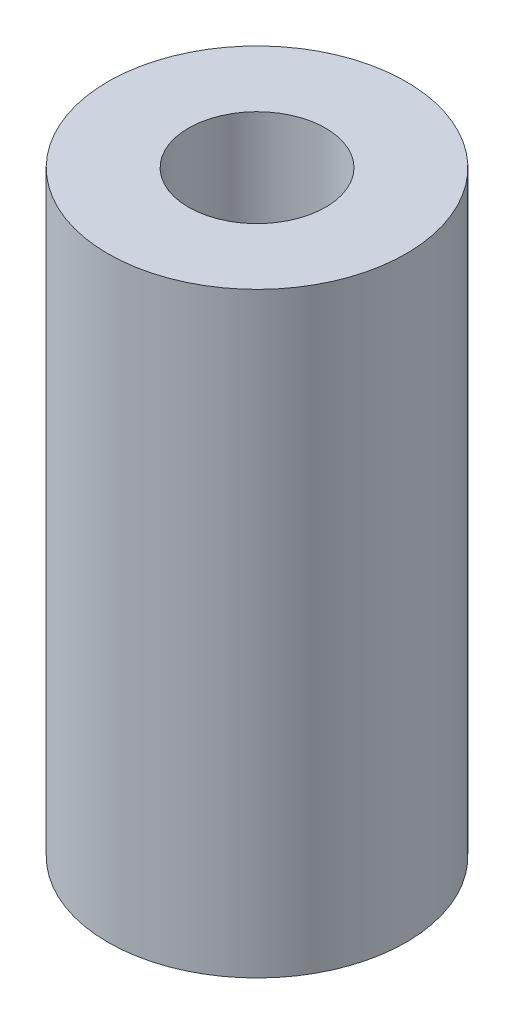
ISO-10303-21;
HEADER;
FILE_DESCRIPTION(('STEP AP214'),'2;1');
FILE_NAME('part.step','',(''),(''),'','','');
FILE_SCHEMA(('AUTOMOTIVE_DESIGN { 1 0 10303 214 1 1 1 1 }'));
ENDSEC;
DATA;
#1=APPLICATION_CONTEXT('core data for automotive mechanical design processes');
#2=APPLICATION_PROTOCOL_DEFINITION('international standard','automotive_design',2000,#1);
#3=PRODUCT_CONTEXT('',#1,'mechanical');
#4=PRODUCT('Part','Part','',(#3));
#5=PRODUCT_RELATED_PRODUCT_CATEGORY('part','',(#4));
#6=PRODUCT_DEFINITION_FORMATION('','',#4);
#7=PRODUCT_DEFINITION_CONTEXT('part definition',#1,'design');
#8=PRODUCT_DEFINITION('design','',#6,#7);
#9=PRODUCT_DEFINITION_SHAPE('','',#8);
#10=(LENGTH_UNIT() NAMED_UNIT(*) SI_UNIT(.MILLI.,.METRE.));
#11=(NAMED_UNIT(*) PLANE_ANGLE_UNIT() SI_UNIT($,.RADIAN.));
#12=(NAMED_UNIT(*) SI_UNIT($,.STERADIAN.) SOLID_ANGLE_UNIT());
#13=UNCERTAINTY_MEASURE_WITH_UNIT(LENGTH_MEASURE(1.E-05),#10,'distance_accuracy_value','');
#14=(GEOMETRIC_REPRESENTATION_CONTEXT(3) GLOBAL_UNCERTAINTY_ASSIGNED_CONTEXT((#13)) GLOBAL_UNIT_ASSIGNED_CONTEXT((#10,
#11,#12)) REPRESENTATION_CONTEXT('',''));
#15=CARTESIAN_POINT('',(0.,0.,0.));
#16=DIRECTION('',(0.,0.,1.));
#17=DIRECTION('',(1.,0.,0.));
#18=AXIS2_PLACEMENT_3D('',#15,#16,#17);
#19=CARTESIAN_POINT('',(0.,10.,0.));
#20=DIRECTION('',(0.,1.,0.));
#21=DIRECTION('',(0.,0.,1.));
#22=AXIS2_PLACEMENT_3D('',#19,#20,#21);
#23=PLANE('',#22);
#24=CARTESIAN_POINT('',(0.,10.,0.));
#25=DIRECTION('',(0.,1.,0.));
#26=DIRECTION('',(0.,0.,1.));
#27=AXIS2_PLACEMENT_3D('',#24,#25,#26);
#28=CIRCLE('',#27,2.5);
#29=CARTESIAN_POINT('',(0.,10.,2.5));
#30=VERTEX_POINT('',#29);
#31=EDGE_CURVE('E10',#30,#30,#28,.T.);
#32=ORIENTED_EDGE('',*,*,#31,.T.);
#33=EDGE_LOOP('',(#32));
#34=FACE_BOUND('',#33,.T.);
#35=CARTESIAN_POINT('',(0.,10.,0.));
#36=DIRECTION('',(0.,1.,0.));
#37=DIRECTION('',(0.,0.,1.));
#38=AXIS2_PLACEMENT_3D('',#35,#36,#37);
#39=CIRCLE('',#38,1.15);
#40=CARTESIAN_POINT('',(0.,10.,1.15));
#41=VERTEX_POINT('',#40);
#42=EDGE_CURVE('E56',#41,#41,#39,.T.);
#43=ORIENTED_EDGE('',*,*,#42,.F.);
#44=EDGE_LOOP('',(#43));
#45=FACE_BOUND('',#44,.T.);
#46=ADVANCED_FACE('F43',(#34,#45),#23,.T.);
#47=CARTESIAN_POINT('',(0.,0.,0.));
#48=DIRECTION('',(0.,1.,0.));
#49=DIRECTION('',(0.,0.,1.));
#50=AXIS2_PLACEMENT_3D('',#47,#48,#49);
#51=PLANE('',#50);
#52=CARTESIAN_POINT('',(0.,0.,0.));
#53=DIRECTION('',(0.,1.,0.));
#54=DIRECTION('',(0.,0.,1.));
#55=AXIS2_PLACEMENT_3D('',#52,#53,#54);
#56=CIRCLE('',#55,2.5);
#57=CARTESIAN_POINT('',(0.,0.,2.5));
#58=VERTEX_POINT('',#57);
#59=EDGE_CURVE('E47',#58,#58,#56,.T.);
#60=ORIENTED_EDGE('',*,*,#59,.F.);
#61=EDGE_LOOP('',(#60));
#62=FACE_BOUND('',#61,.T.);
#63=CARTESIAN_POINT('',(0.,0.,0.));
#64=DIRECTION('',(0.,1.,0.));
#65=DIRECTION('',(0.,0.,1.));
#66=AXIS2_PLACEMENT_3D('',#63,#64,#65);
#67=CIRCLE('',#66,1.15);
#68=CARTESIAN_POINT('',(0.,0.,1.15));
#69=VERTEX_POINT('',#68);
#70=EDGE_CURVE('E58',#69,#69,#67,.T.);
#71=ORIENTED_EDGE('',*,*,#70,.T.);
#72=EDGE_LOOP('',(#71));
#73=FACE_BOUND('',#72,.T.);
#74=ADVANCED_FACE('F70',(#62,#73),#51,.F.);
#75=CARTESIAN_POINT('',(0.,10.,0.));
#76=DIRECTION('',(0.,-1.,0.));
#77=DIRECTION('',(0.,0.,-1.));
#78=AXIS2_PLACEMENT_3D('',#75,#76,#77);
#79=CYLINDRICAL_SURFACE('',#78,2.5);
#80=ORIENTED_EDGE('',*,*,#31,.F.);
#81=EDGE_LOOP('',(#80));
#82=FACE_BOUND('',#81,.T.);
#83=ORIENTED_EDGE('',*,*,#59,.T.);
#84=EDGE_LOOP('',(#83));
#85=FACE_BOUND('',#84,.T.);
#86=ADVANCED_FACE('F45',(#82,#85),#79,.T.);
#87=CARTESIAN_POINT('',(0.,10.,0.));
#88=DIRECTION('',(0.,-1.,0.));
#89=DIRECTION('',(0.,0.,-1.));
#90=AXIS2_PLACEMENT_3D('',#87,#88,#89);
#91=CYLINDRICAL_SURFACE('',#90,1.15);
#92=ORIENTED_EDGE('',*,*,#42,.T.);
#93=EDGE_LOOP('',(#92));
#94=FACE_BOUND('',#93,.T.);
#95=ORIENTED_EDGE('',*,*,#70,.F.);
#96=EDGE_LOOP('',(#95));
#97=FACE_BOUND('',#96,.T.);
#98=ADVANCED_FACE('F66',(#94,#97),#91,.F.);
#99=CLOSED_SHELL('',(#46,#74,#86,#98));
#100=MANIFOLD_SOLID_BREP('B2',#99);
#101=ADVANCED_BREP_SHAPE_REPRESENTATION('',(#18,#100),#14);
#102=SHAPE_DEFINITION_REPRESENTATION(#9,#101);
ENDSEC;
END-ISO-10303-21;
